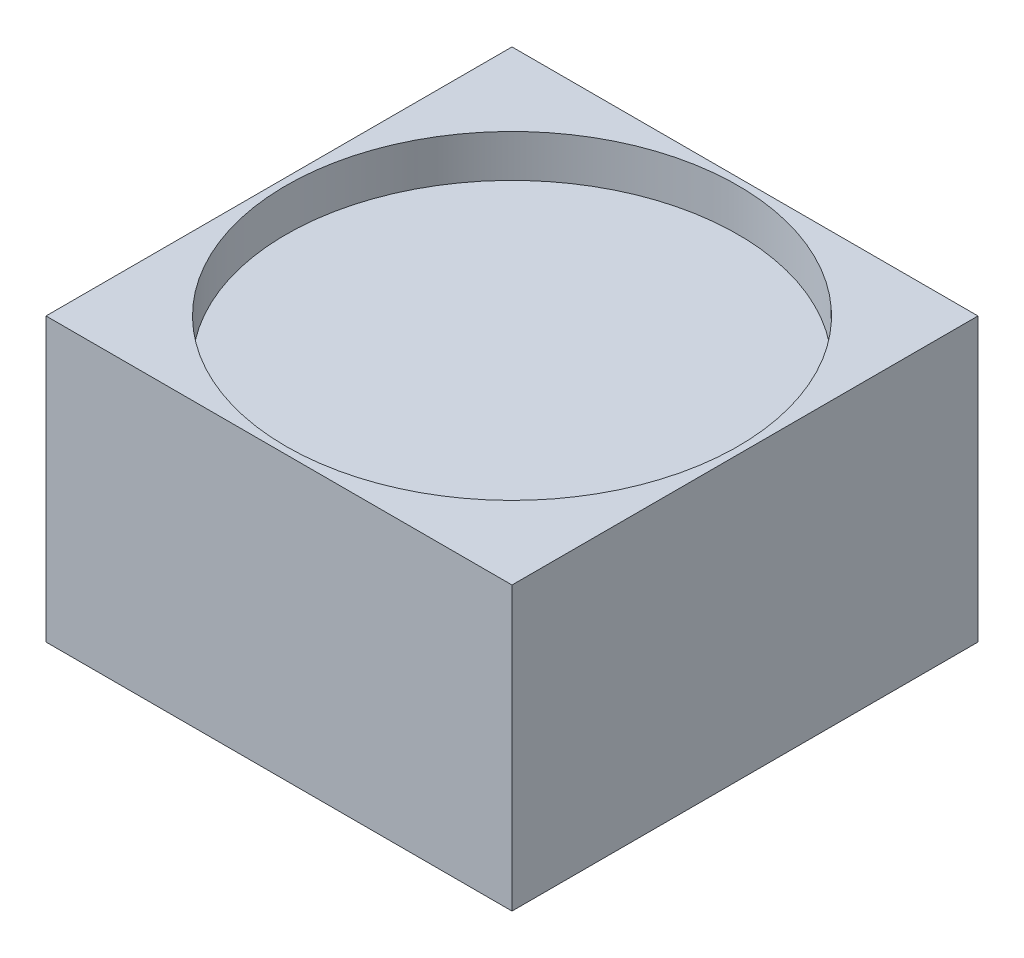
ISO-10303-21;
HEADER;
FILE_DESCRIPTION(('STEP AP214'),'2;1');
FILE_NAME('part.step','',(''),(''),'','','');
FILE_SCHEMA(('AUTOMOTIVE_DESIGN { 1 0 10303 214 1 1 1 1 }'));
ENDSEC;
DATA;
#1=APPLICATION_CONTEXT('core data for automotive mechanical design processes');
#2=APPLICATION_PROTOCOL_DEFINITION('international standard','automotive_design',2000,#1);
#3=PRODUCT_CONTEXT('',#1,'mechanical');
#4=PRODUCT('Part','Part','',(#3));
#5=PRODUCT_RELATED_PRODUCT_CATEGORY('part','',(#4));
#6=PRODUCT_DEFINITION_FORMATION('','',#4);
#7=PRODUCT_DEFINITION_CONTEXT('part definition',#1,'design');
#8=PRODUCT_DEFINITION('design','',#6,#7);
#9=PRODUCT_DEFINITION_SHAPE('','',#8);
#10=(LENGTH_UNIT() NAMED_UNIT(*) SI_UNIT(.MILLI.,.METRE.));
#11=(NAMED_UNIT(*) PLANE_ANGLE_UNIT() SI_UNIT($,.RADIAN.));
#12=(NAMED_UNIT(*) SI_UNIT($,.STERADIAN.) SOLID_ANGLE_UNIT());
#13=UNCERTAINTY_MEASURE_WITH_UNIT(LENGTH_MEASURE(1.E-05),#10,'distance_accuracy_value','');
#14=(GEOMETRIC_REPRESENTATION_CONTEXT(3) GLOBAL_UNCERTAINTY_ASSIGNED_CONTEXT((#13)) GLOBAL_UNIT_ASSIGNED_CONTEXT((#10,
#11,#12)) REPRESENTATION_CONTEXT('',''));
#15=CARTESIAN_POINT('',(0.,0.,0.));
#16=DIRECTION('',(0.,0.,1.));
#17=DIRECTION('',(1.,0.,0.));
#18=AXIS2_PLACEMENT_3D('',#15,#16,#17);
#19=CARTESIAN_POINT('',(16.5,20.,16.5));
#20=DIRECTION('',(-1.,0.,0.));
#21=DIRECTION('',(0.,0.,1.));
#22=AXIS2_PLACEMENT_3D('',#19,#20,#21);
#23=PLANE('',#22);
#24=DIRECTION('',(0.,0.,-1.));
#25=VECTOR('',#24,1.);
#26=CARTESIAN_POINT('',(16.5,0.,16.5));
#27=LINE('',#26,#25);
#28=CARTESIAN_POINT('',(16.5,0.,16.5));
#29=VERTEX_POINT('',#28);
#30=CARTESIAN_POINT('',(16.5,0.,-16.5));
#31=VERTEX_POINT('',#30);
#32=EDGE_CURVE('E100',#29,#31,#27,.T.);
#33=ORIENTED_EDGE('',*,*,#32,.T.);
#34=DIRECTION('',(0.,-1.,0.));
#35=VECTOR('',#34,1.);
#36=CARTESIAN_POINT('',(16.5,20.,-16.5));
#37=LINE('',#36,#35);
#38=CARTESIAN_POINT('',(16.5,20.,-16.5));
#39=VERTEX_POINT('',#38);
#40=EDGE_CURVE('E42',#39,#31,#37,.T.);
#41=ORIENTED_EDGE('',*,*,#40,.F.);
#42=DIRECTION('',(0.,0.,-1.));
#43=VECTOR('',#42,1.);
#44=CARTESIAN_POINT('',(16.5,20.,16.5));
#45=LINE('',#44,#43);
#46=CARTESIAN_POINT('',(16.5,20.,16.5));
#47=VERTEX_POINT('',#46);
#48=EDGE_CURVE('E86',#47,#39,#45,.T.);
#49=ORIENTED_EDGE('',*,*,#48,.F.);
#50=DIRECTION('',(0.,-1.,0.));
#51=VECTOR('',#50,1.);
#52=CARTESIAN_POINT('',(16.5,20.,16.5));
#53=LINE('',#52,#51);
#54=EDGE_CURVE('E96',#47,#29,#53,.T.);
#55=ORIENTED_EDGE('',*,*,#54,.T.);
#56=EDGE_LOOP('',(#33,#41,#49,#55));
#57=FACE_BOUND('',#56,.T.);
#58=ADVANCED_FACE('F33',(#57),#23,.F.);
#59=CARTESIAN_POINT('',(-16.5,20.,-16.5));
#60=DIRECTION('',(0.,0.,1.));
#61=DIRECTION('',(1.,0.,0.));
#62=AXIS2_PLACEMENT_3D('',#59,#60,#61);
#63=PLANE('',#62);
#64=DIRECTION('',(-1.,0.,0.));
#65=VECTOR('',#64,1.);
#66=CARTESIAN_POINT('',(-16.5,0.,-16.5));
#67=LINE('',#66,#65);
#68=CARTESIAN_POINT('',(-16.5,0.,-16.5));
#69=VERTEX_POINT('',#68);
#70=EDGE_CURVE('E91',#31,#69,#67,.T.);
#71=ORIENTED_EDGE('',*,*,#70,.T.);
#72=DIRECTION('',(0.,-1.,0.));
#73=VECTOR('',#72,1.);
#74=CARTESIAN_POINT('',(-16.5,20.,-16.5));
#75=LINE('',#74,#73);
#76=CARTESIAN_POINT('',(-16.5,20.,-16.5));
#77=VERTEX_POINT('',#76);
#78=EDGE_CURVE('E89',#77,#69,#75,.T.);
#79=ORIENTED_EDGE('',*,*,#78,.F.);
#80=DIRECTION('',(-1.,0.,0.));
#81=VECTOR('',#80,1.);
#82=CARTESIAN_POINT('',(-16.5,20.,-16.5));
#83=LINE('',#82,#81);
#84=EDGE_CURVE('E81',#39,#77,#83,.T.);
#85=ORIENTED_EDGE('',*,*,#84,.F.);
#86=ORIENTED_EDGE('',*,*,#40,.T.);
#87=EDGE_LOOP('',(#71,#79,#85,#86));
#88=FACE_BOUND('',#87,.T.);
#89=ADVANCED_FACE('F90',(#88),#63,.F.);
#90=CARTESIAN_POINT('',(-16.5,20.,16.5));
#91=DIRECTION('',(1.,0.,0.));
#92=DIRECTION('',(0.,0.,-1.));
#93=AXIS2_PLACEMENT_3D('',#90,#91,#92);
#94=PLANE('',#93);
#95=DIRECTION('',(0.,0.,1.));
#96=VECTOR('',#95,1.);
#97=CARTESIAN_POINT('',(-16.5,0.,16.5));
#98=LINE('',#97,#96);
#99=CARTESIAN_POINT('',(-16.5,0.,16.5));
#100=VERTEX_POINT('',#99);
#101=EDGE_CURVE('E67',#69,#100,#98,.T.);
#102=ORIENTED_EDGE('',*,*,#101,.T.);
#103=DIRECTION('',(0.,-1.,0.));
#104=VECTOR('',#103,1.);
#105=CARTESIAN_POINT('',(-16.5,20.,16.5));
#106=LINE('',#105,#104);
#107=CARTESIAN_POINT('',(-16.5,20.,16.5));
#108=VERTEX_POINT('',#107);
#109=EDGE_CURVE('E92',#108,#100,#106,.T.);
#110=ORIENTED_EDGE('',*,*,#109,.F.);
#111=DIRECTION('',(0.,0.,1.));
#112=VECTOR('',#111,1.);
#113=CARTESIAN_POINT('',(-16.5,20.,16.5));
#114=LINE('',#113,#112);
#115=EDGE_CURVE('E84',#77,#108,#114,.T.);
#116=ORIENTED_EDGE('',*,*,#115,.F.);
#117=ORIENTED_EDGE('',*,*,#78,.T.);
#118=EDGE_LOOP('',(#102,#110,#116,#117));
#119=FACE_BOUND('',#118,.T.);
#120=ADVANCED_FACE('F94',(#119),#94,.F.);
#121=CARTESIAN_POINT('',(-16.5,20.,16.5));
#122=DIRECTION('',(0.,0.,-1.));
#123=DIRECTION('',(-1.,0.,0.));
#124=AXIS2_PLACEMENT_3D('',#121,#122,#123);
#125=PLANE('',#124);
#126=DIRECTION('',(1.,0.,0.));
#127=VECTOR('',#126,1.);
#128=CARTESIAN_POINT('',(-16.5,0.,16.5));
#129=LINE('',#128,#127);
#130=EDGE_CURVE('E73',#100,#29,#129,.T.);
#131=ORIENTED_EDGE('',*,*,#130,.T.);
#132=ORIENTED_EDGE('',*,*,#54,.F.);
#133=DIRECTION('',(1.,0.,0.));
#134=VECTOR('',#133,1.);
#135=CARTESIAN_POINT('',(-16.5,20.,16.5));
#136=LINE('',#135,#134);
#137=EDGE_CURVE('E50',#108,#47,#136,.T.);
#138=ORIENTED_EDGE('',*,*,#137,.F.);
#139=ORIENTED_EDGE('',*,*,#109,.T.);
#140=EDGE_LOOP('',(#131,#132,#138,#139));
#141=FACE_BOUND('',#140,.T.);
#142=ADVANCED_FACE('F125',(#141),#125,.F.);
#143=CARTESIAN_POINT('',(0.,20.,0.));
#144=DIRECTION('',(0.,-1.,0.));
#145=DIRECTION('',(0.,0.,-1.));
#146=AXIS2_PLACEMENT_3D('',#143,#144,#145);
#147=PLANE('',#146);
#148=CARTESIAN_POINT('',(0.,20.,0.));
#149=DIRECTION('',(0.,1.,0.));
#150=DIRECTION('',(0.,0.,1.));
#151=AXIS2_PLACEMENT_3D('',#148,#149,#150);
#152=CIRCLE('',#151,16.);
#153=CARTESIAN_POINT('',(0.,20.,16.));
#154=VERTEX_POINT('',#153);
#155=EDGE_CURVE('E187',#154,#154,#152,.T.);
#156=ORIENTED_EDGE('',*,*,#155,.F.);
#157=EDGE_LOOP('',(#156));
#158=FACE_BOUND('',#157,.T.);
#159=ORIENTED_EDGE('',*,*,#48,.T.);
#160=ORIENTED_EDGE('',*,*,#84,.T.);
#161=ORIENTED_EDGE('',*,*,#115,.T.);
#162=ORIENTED_EDGE('',*,*,#137,.T.);
#163=EDGE_LOOP('',(#159,#160,#161,#162));
#164=FACE_BOUND('',#163,.T.);
#165=ADVANCED_FACE('F82',(#158,#164),#147,.F.);
#166=CARTESIAN_POINT('',(0.,0.,0.));
#167=DIRECTION('',(0.,-1.,0.));
#168=DIRECTION('',(0.,0.,-1.));
#169=AXIS2_PLACEMENT_3D('',#166,#167,#168);
#170=PLANE('',#169);
#171=CARTESIAN_POINT('',(0.,0.,0.));
#172=DIRECTION('',(0.,-1.,0.));
#173=DIRECTION('',(0.,0.,-1.));
#174=AXIS2_PLACEMENT_3D('',#171,#172,#173);
#175=CIRCLE('',#174,1.);
#176=CARTESIAN_POINT('',(0.,0.,-1.));
#177=VERTEX_POINT('',#176);
#178=EDGE_CURVE('E186',#177,#177,#175,.T.);
#179=ORIENTED_EDGE('',*,*,#178,.F.);
#180=EDGE_LOOP('',(#179));
#181=FACE_BOUND('',#180,.T.);
#182=ORIENTED_EDGE('',*,*,#32,.F.);
#183=ORIENTED_EDGE('',*,*,#130,.F.);
#184=ORIENTED_EDGE('',*,*,#101,.F.);
#185=ORIENTED_EDGE('',*,*,#70,.F.);
#186=EDGE_LOOP('',(#182,#183,#184,#185));
#187=FACE_BOUND('',#186,.T.);
#188=ADVANCED_FACE('F111',(#181,#187),#170,.T.);
#189=CARTESIAN_POINT('',(0.,17.,0.));
#190=DIRECTION('',(0.,1.,0.));
#191=DIRECTION('',(0.,0.,1.));
#192=AXIS2_PLACEMENT_3D('',#189,#190,#191);
#193=CYLINDRICAL_SURFACE('',#192,16.);
#194=CARTESIAN_POINT('',(0.,17.,0.));
#195=DIRECTION('',(0.,1.,0.));
#196=DIRECTION('',(0.,0.,1.));
#197=AXIS2_PLACEMENT_3D('',#194,#195,#196);
#198=CIRCLE('',#197,16.);
#199=CARTESIAN_POINT('',(0.,17.,16.));
#200=VERTEX_POINT('',#199);
#201=EDGE_CURVE('E103',#200,#200,#198,.T.);
#202=ORIENTED_EDGE('',*,*,#201,.F.);
#203=EDGE_LOOP('',(#202));
#204=FACE_BOUND('',#203,.T.);
#205=ORIENTED_EDGE('',*,*,#155,.T.);
#206=EDGE_LOOP('',(#205));
#207=FACE_BOUND('',#206,.T.);
#208=ADVANCED_FACE('F113',(#204,#207),#193,.F.);
#209=CARTESIAN_POINT('',(0.,17.,0.));
#210=DIRECTION('',(0.,1.,0.));
#211=DIRECTION('',(0.,0.,1.));
#212=AXIS2_PLACEMENT_3D('',#209,#210,#211);
#213=PLANE('',#212);
#214=ORIENTED_EDGE('',*,*,#201,.T.);
#215=EDGE_LOOP('',(#214));
#216=FACE_BOUND('',#215,.T.);
#217=ADVANCED_FACE('F121',(#216),#213,.T.);
#218=CARTESIAN_POINT('',(0.,2.,0.));
#219=DIRECTION('',(0.,-1.,0.));
#220=DIRECTION('',(0.,0.,-1.));
#221=AXIS2_PLACEMENT_3D('',#218,#219,#220);
#222=CYLINDRICAL_SURFACE('',#221,1.);
#223=CARTESIAN_POINT('',(0.,1.,0.));
#224=DIRECTION('',(0.,-1.,0.));
#225=DIRECTION('',(0.,0.,-1.));
#226=AXIS2_PLACEMENT_3D('',#223,#224,#225);
#227=CIRCLE('',#226,1.);
#228=CARTESIAN_POINT('',(0.,1.,-1.));
#229=VERTEX_POINT('',#228);
#230=EDGE_CURVE('E11',#229,#229,#227,.F.);
#231=ORIENTED_EDGE('',*,*,#230,.T.);
#232=EDGE_LOOP('',(#231));
#233=FACE_BOUND('',#232,.T.);
#234=ORIENTED_EDGE('',*,*,#178,.T.);
#235=EDGE_LOOP('',(#234));
#236=FACE_BOUND('',#235,.T.);
#237=ADVANCED_FACE('F159',(#233,#236),#222,.F.);
#238=CARTESIAN_POINT('',(0.,1.,0.));
#239=DIRECTION('',(0.,-1.,0.));
#240=DIRECTION('',(0.,0.,-1.));
#241=AXIS2_PLACEMENT_3D('',#238,#239,#240);
#242=SPHERICAL_SURFACE('',#241,1.);
#243=ORIENTED_EDGE('',*,*,#230,.F.);
#244=EDGE_LOOP('',(#243));
#245=FACE_BOUND('',#244,.T.);
#246=ADVANCED_FACE('F35',(#245),#242,.F.);
#247=CLOSED_SHELL('',(#58,#89,#120,#142,#165,#188,#208,#217,#237,#246));
#248=MANIFOLD_SOLID_BREP('B2',#247);
#249=ADVANCED_BREP_SHAPE_REPRESENTATION('',(#18,#248),#14);
#250=SHAPE_DEFINITION_REPRESENTATION(#9,#249);
ENDSEC;
END-ISO-10303-21;
